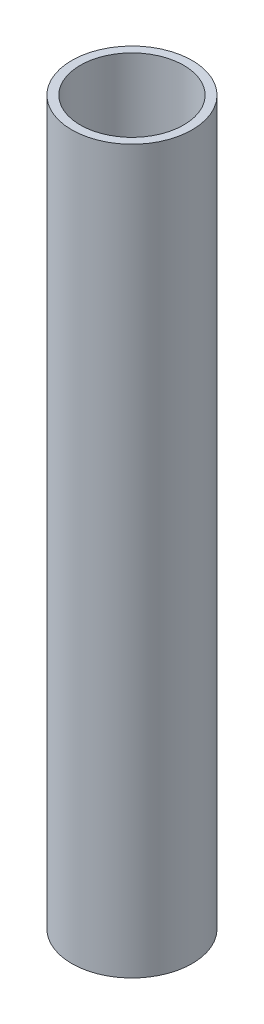
ISO-10303-21;
HEADER;
FILE_DESCRIPTION(('STEP AP214'),'2;1');
FILE_NAME('part.step','',(''),(''),'','','');
FILE_SCHEMA(('AUTOMOTIVE_DESIGN { 1 0 10303 214 1 1 1 1 }'));
ENDSEC;
DATA;
#1=APPLICATION_CONTEXT('core data for automotive mechanical design processes');
#2=APPLICATION_PROTOCOL_DEFINITION('international standard','automotive_design',2000,#1);
#3=PRODUCT_CONTEXT('',#1,'mechanical');
#4=PRODUCT('Part','Part','',(#3));
#5=PRODUCT_RELATED_PRODUCT_CATEGORY('part','',(#4));
#6=PRODUCT_DEFINITION_FORMATION('','',#4);
#7=PRODUCT_DEFINITION_CONTEXT('part definition',#1,'design');
#8=PRODUCT_DEFINITION('design','',#6,#7);
#9=PRODUCT_DEFINITION_SHAPE('','',#8);
#10=(LENGTH_UNIT() NAMED_UNIT(*) SI_UNIT(.MILLI.,.METRE.));
#11=(NAMED_UNIT(*) PLANE_ANGLE_UNIT() SI_UNIT($,.RADIAN.));
#12=(NAMED_UNIT(*) SI_UNIT($,.STERADIAN.) SOLID_ANGLE_UNIT());
#13=UNCERTAINTY_MEASURE_WITH_UNIT(LENGTH_MEASURE(1.E-05),#10,'distance_accuracy_value','');
#14=(GEOMETRIC_REPRESENTATION_CONTEXT(3) GLOBAL_UNCERTAINTY_ASSIGNED_CONTEXT((#13)) GLOBAL_UNIT_ASSIGNED_CONTEXT((#10,
#11,#12)) REPRESENTATION_CONTEXT('',''));
#15=CARTESIAN_POINT('',(0.,0.,0.));
#16=DIRECTION('',(0.,0.,1.));
#17=DIRECTION('',(1.,0.,0.));
#18=AXIS2_PLACEMENT_3D('',#15,#16,#17);
#19=CARTESIAN_POINT('',(0.,300.,0.));
#20=DIRECTION('',(0.,1.,0.));
#21=DIRECTION('',(0.,0.,1.));
#22=AXIS2_PLACEMENT_3D('',#19,#20,#21);
#23=PLANE('',#22);
#24=CARTESIAN_POINT('',(0.,300.,0.));
#25=DIRECTION('',(0.,1.,0.));
#26=DIRECTION('',(0.,0.,1.));
#27=AXIS2_PLACEMENT_3D('',#24,#25,#26);
#28=CIRCLE('',#27,25.);
#29=CARTESIAN_POINT('',(0.,300.,25.));
#30=VERTEX_POINT('',#29);
#31=EDGE_CURVE('E11',#30,#30,#28,.T.);
#32=ORIENTED_EDGE('',*,*,#31,.T.);
#33=EDGE_LOOP('',(#32));
#34=FACE_BOUND('',#33,.T.);
#35=CARTESIAN_POINT('',(0.,300.,0.));
#36=DIRECTION('',(0.,1.,0.));
#37=DIRECTION('',(1.,0.,0.));
#38=AXIS2_PLACEMENT_3D('',#35,#36,#37);
#39=CIRCLE('',#38,21.5);
#40=CARTESIAN_POINT('',(21.5,300.,0.));
#41=VERTEX_POINT('',#40);
#42=EDGE_CURVE('E50',#41,#41,#39,.T.);
#43=ORIENTED_EDGE('',*,*,#42,.F.);
#44=EDGE_LOOP('',(#43));
#45=FACE_BOUND('',#44,.T.);
#46=ADVANCED_FACE('F39',(#34,#45),#23,.T.);
#47=CARTESIAN_POINT('',(0.,0.,0.));
#48=DIRECTION('',(0.,1.,0.));
#49=DIRECTION('',(0.,0.,1.));
#50=AXIS2_PLACEMENT_3D('',#47,#48,#49);
#51=PLANE('',#50);
#52=CARTESIAN_POINT('',(0.,0.,0.));
#53=DIRECTION('',(0.,1.,0.));
#54=DIRECTION('',(0.,0.,1.));
#55=AXIS2_PLACEMENT_3D('',#52,#53,#54);
#56=CIRCLE('',#55,25.);
#57=CARTESIAN_POINT('',(0.,0.,25.));
#58=VERTEX_POINT('',#57);
#59=EDGE_CURVE('E43',#58,#58,#56,.T.);
#60=ORIENTED_EDGE('',*,*,#59,.F.);
#61=EDGE_LOOP('',(#60));
#62=FACE_BOUND('',#61,.T.);
#63=CARTESIAN_POINT('',(0.,0.,0.));
#64=DIRECTION('',(0.,1.,0.));
#65=DIRECTION('',(1.,0.,0.));
#66=AXIS2_PLACEMENT_3D('',#63,#64,#65);
#67=CIRCLE('',#66,21.5);
#68=CARTESIAN_POINT('',(21.5,0.,0.));
#69=VERTEX_POINT('',#68);
#70=EDGE_CURVE('E52',#69,#69,#67,.T.);
#71=ORIENTED_EDGE('',*,*,#70,.T.);
#72=EDGE_LOOP('',(#71));
#73=FACE_BOUND('',#72,.T.);
#74=ADVANCED_FACE('F62',(#62,#73),#51,.F.);
#75=CARTESIAN_POINT('',(0.,300.,0.));
#76=DIRECTION('',(0.,-1.,0.));
#77=DIRECTION('',(0.,0.,-1.));
#78=AXIS2_PLACEMENT_3D('',#75,#76,#77);
#79=CYLINDRICAL_SURFACE('',#78,25.);
#80=ORIENTED_EDGE('',*,*,#31,.F.);
#81=EDGE_LOOP('',(#80));
#82=FACE_BOUND('',#81,.T.);
#83=ORIENTED_EDGE('',*,*,#59,.T.);
#84=EDGE_LOOP('',(#83));
#85=FACE_BOUND('',#84,.T.);
#86=ADVANCED_FACE('F41',(#82,#85),#79,.T.);
#87=CARTESIAN_POINT('',(0.,300.,0.));
#88=DIRECTION('',(0.,-1.,0.));
#89=DIRECTION('',(0.,0.,-1.));
#90=AXIS2_PLACEMENT_3D('',#87,#88,#89);
#91=CYLINDRICAL_SURFACE('',#90,21.5);
#92=ORIENTED_EDGE('',*,*,#42,.T.);
#93=EDGE_LOOP('',(#92));
#94=FACE_BOUND('',#93,.T.);
#95=ORIENTED_EDGE('',*,*,#70,.F.);
#96=EDGE_LOOP('',(#95));
#97=FACE_BOUND('',#96,.T.);
#98=ADVANCED_FACE('F58',(#94,#97),#91,.F.);
#99=CLOSED_SHELL('',(#46,#74,#86,#98));
#100=MANIFOLD_SOLID_BREP('B2',#99);
#101=ADVANCED_BREP_SHAPE_REPRESENTATION('',(#18,#100),#14);
#102=SHAPE_DEFINITION_REPRESENTATION(#9,#101);
ENDSEC;
END-ISO-10303-21;
